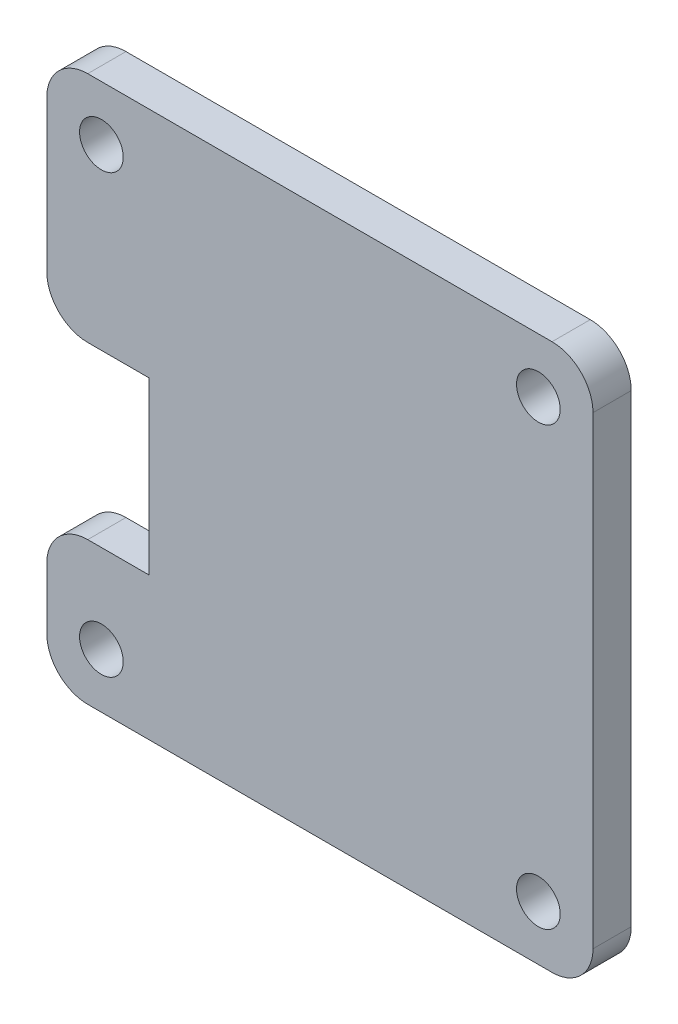
ISO-10303-21;
HEADER;
FILE_DESCRIPTION(('STEP AP214'),'2;1');
FILE_NAME('part.step','',(''),(''),'','','');
FILE_SCHEMA(('AUTOMOTIVE_DESIGN { 1 0 10303 214 1 1 1 1 }'));
ENDSEC;
DATA;
#1=APPLICATION_CONTEXT('core data for automotive mechanical design processes');
#2=APPLICATION_PROTOCOL_DEFINITION('international standard','automotive_design',2000,#1);
#3=PRODUCT_CONTEXT('',#1,'mechanical');
#4=PRODUCT('Part','Part','',(#3));
#5=PRODUCT_RELATED_PRODUCT_CATEGORY('part','',(#4));
#6=PRODUCT_DEFINITION_FORMATION('','',#4);
#7=PRODUCT_DEFINITION_CONTEXT('part definition',#1,'design');
#8=PRODUCT_DEFINITION('design','',#6,#7);
#9=PRODUCT_DEFINITION_SHAPE('','',#8);
#10=(LENGTH_UNIT() NAMED_UNIT(*) SI_UNIT(.MILLI.,.METRE.));
#11=(NAMED_UNIT(*) PLANE_ANGLE_UNIT() SI_UNIT($,.RADIAN.));
#12=(NAMED_UNIT(*) SI_UNIT($,.STERADIAN.) SOLID_ANGLE_UNIT());
#13=UNCERTAINTY_MEASURE_WITH_UNIT(LENGTH_MEASURE(1.E-05),#10,'distance_accuracy_value','');
#14=(GEOMETRIC_REPRESENTATION_CONTEXT(3) GLOBAL_UNCERTAINTY_ASSIGNED_CONTEXT((#13)) GLOBAL_UNIT_ASSIGNED_CONTEXT((#10,
#11,#12)) REPRESENTATION_CONTEXT('',''));
#15=CARTESIAN_POINT('',(0.,0.,0.));
#16=DIRECTION('',(0.,0.,1.));
#17=DIRECTION('',(1.,0.,0.));
#18=AXIS2_PLACEMENT_3D('',#15,#16,#17);
#19=CARTESIAN_POINT('',(0.,0.,2.8));
#20=DIRECTION('',(0.,0.,1.));
#21=DIRECTION('',(1.,0.,0.));
#22=AXIS2_PLACEMENT_3D('',#19,#20,#21);
#23=PLANE('',#22);
#24=CARTESIAN_POINT('',(16.,-16.,2.8));
#25=DIRECTION('',(0.,0.,1.));
#26=DIRECTION('',(1.,0.,0.));
#27=AXIS2_PLACEMENT_3D('',#24,#25,#26);
#28=CIRCLE('',#27,1.6);
#29=CARTESIAN_POINT('',(17.6,-16.,2.8));
#30=VERTEX_POINT('',#29);
#31=EDGE_CURVE('E280',#30,#30,#28,.T.);
#32=ORIENTED_EDGE('',*,*,#31,.F.);
#33=EDGE_LOOP('',(#32));
#34=FACE_BOUND('',#33,.T.);
#35=CARTESIAN_POINT('',(-16.,16.,2.8));
#36=DIRECTION('',(0.,0.,1.));
#37=DIRECTION('',(1.,0.,0.));
#38=AXIS2_PLACEMENT_3D('',#35,#36,#37);
#39=CIRCLE('',#38,1.6);
#40=CARTESIAN_POINT('',(-14.4,16.,2.8));
#41=VERTEX_POINT('',#40);
#42=EDGE_CURVE('E175',#41,#41,#39,.T.);
#43=ORIENTED_EDGE('',*,*,#42,.F.);
#44=EDGE_LOOP('',(#43));
#45=FACE_BOUND('',#44,.T.);
#46=DIRECTION('',(-1.,0.,0.));
#47=VECTOR('',#46,1.);
#48=CARTESIAN_POINT('',(-12.5,-9.54999999999999,2.8));
#49=LINE('',#48,#47);
#50=CARTESIAN_POINT('',(-12.5,-9.54999999999999,2.8));
#51=VERTEX_POINT('',#50);
#52=CARTESIAN_POINT('',(-17.,-9.54999999999999,2.8));
#53=VERTEX_POINT('',#52);
#54=EDGE_CURVE('E162',#51,#53,#49,.T.);
#55=ORIENTED_EDGE('',*,*,#54,.T.);
#56=CARTESIAN_POINT('',(-17.,-12.55,2.8));
#57=DIRECTION('',(0.,0.,1.));
#58=DIRECTION('',(1.,0.,0.));
#59=AXIS2_PLACEMENT_3D('',#56,#57,#58);
#60=CIRCLE('',#59,3.);
#61=CARTESIAN_POINT('',(-20.,-12.55,2.8));
#62=VERTEX_POINT('',#61);
#63=EDGE_CURVE('E220',#53,#62,#60,.T.);
#64=ORIENTED_EDGE('',*,*,#63,.T.);
#65=DIRECTION('',(0.,-1.,0.));
#66=VECTOR('',#65,1.);
#67=CARTESIAN_POINT('',(-20.,-9.54999999999999,2.8));
#68=LINE('',#67,#66);
#69=CARTESIAN_POINT('',(-20.,-17.,2.8));
#70=VERTEX_POINT('',#69);
#71=EDGE_CURVE('E164',#62,#70,#68,.T.);
#72=ORIENTED_EDGE('',*,*,#71,.T.);
#73=CARTESIAN_POINT('',(-17.,-17.,2.8));
#74=DIRECTION('',(0.,0.,1.));
#75=DIRECTION('',(1.,0.,0.));
#76=AXIS2_PLACEMENT_3D('',#73,#74,#75);
#77=CIRCLE('',#76,3.);
#78=CARTESIAN_POINT('',(-17.,-20.,2.8));
#79=VERTEX_POINT('',#78);
#80=EDGE_CURVE('E55',#70,#79,#77,.T.);
#81=ORIENTED_EDGE('',*,*,#80,.T.);
#82=DIRECTION('',(1.,0.,0.));
#83=VECTOR('',#82,1.);
#84=CARTESIAN_POINT('',(-20.,-20.,2.8));
#85=LINE('',#84,#83);
#86=CARTESIAN_POINT('',(17.,-20.,2.8));
#87=VERTEX_POINT('',#86);
#88=EDGE_CURVE('E169',#79,#87,#85,.T.);
#89=ORIENTED_EDGE('',*,*,#88,.T.);
#90=CARTESIAN_POINT('',(17.,-17.,2.8));
#91=DIRECTION('',(0.,0.,1.));
#92=DIRECTION('',(1.,0.,0.));
#93=AXIS2_PLACEMENT_3D('',#90,#91,#92);
#94=CIRCLE('',#93,3.);
#95=CARTESIAN_POINT('',(20.,-17.,2.8));
#96=VERTEX_POINT('',#95);
#97=EDGE_CURVE('E214',#87,#96,#94,.T.);
#98=ORIENTED_EDGE('',*,*,#97,.T.);
#99=DIRECTION('',(0.,1.,0.));
#100=VECTOR('',#99,1.);
#101=CARTESIAN_POINT('',(20.,20.,2.8));
#102=LINE('',#101,#100);
#103=CARTESIAN_POINT('',(20.,17.,2.8));
#104=VERTEX_POINT('',#103);
#105=EDGE_CURVE('E192',#96,#104,#102,.T.);
#106=ORIENTED_EDGE('',*,*,#105,.T.);
#107=CARTESIAN_POINT('',(17.,17.,2.8));
#108=DIRECTION('',(0.,0.,1.));
#109=DIRECTION('',(1.,0.,0.));
#110=AXIS2_PLACEMENT_3D('',#107,#108,#109);
#111=CIRCLE('',#110,3.);
#112=CARTESIAN_POINT('',(17.,20.,2.8));
#113=VERTEX_POINT('',#112);
#114=EDGE_CURVE('E212',#104,#113,#111,.T.);
#115=ORIENTED_EDGE('',*,*,#114,.T.);
#116=DIRECTION('',(-1.,0.,0.));
#117=VECTOR('',#116,1.);
#118=CARTESIAN_POINT('',(-20.,20.,2.8));
#119=LINE('',#118,#117);
#120=CARTESIAN_POINT('',(-17.,20.,2.8));
#121=VERTEX_POINT('',#120);
#122=EDGE_CURVE('E249',#113,#121,#119,.T.);
#123=ORIENTED_EDGE('',*,*,#122,.T.);
#124=CARTESIAN_POINT('',(-17.,17.,2.8));
#125=DIRECTION('',(0.,0.,1.));
#126=DIRECTION('',(1.,0.,0.));
#127=AXIS2_PLACEMENT_3D('',#124,#125,#126);
#128=CIRCLE('',#127,3.);
#129=CARTESIAN_POINT('',(-20.,17.,2.8));
#130=VERTEX_POINT('',#129);
#131=EDGE_CURVE('E216',#121,#130,#128,.T.);
#132=ORIENTED_EDGE('',*,*,#131,.T.);
#133=DIRECTION('',(0.,-1.,0.));
#134=VECTOR('',#133,1.);
#135=CARTESIAN_POINT('',(-20.,2.95000000000001,2.8));
#136=LINE('',#135,#134);
#137=CARTESIAN_POINT('',(-20.,5.95000000000001,2.8));
#138=VERTEX_POINT('',#137);
#139=EDGE_CURVE('E147',#130,#138,#136,.T.);
#140=ORIENTED_EDGE('',*,*,#139,.T.);
#141=CARTESIAN_POINT('',(-17.,5.95000000000001,2.8));
#142=DIRECTION('',(0.,0.,1.));
#143=DIRECTION('',(1.,0.,0.));
#144=AXIS2_PLACEMENT_3D('',#141,#142,#143);
#145=CIRCLE('',#144,3.);
#146=CARTESIAN_POINT('',(-17.,2.95000000000001,2.8));
#147=VERTEX_POINT('',#146);
#148=EDGE_CURVE('E143',#138,#147,#145,.T.);
#149=ORIENTED_EDGE('',*,*,#148,.T.);
#150=DIRECTION('',(1.,0.,0.));
#151=VECTOR('',#150,1.);
#152=CARTESIAN_POINT('',(-12.5,2.95000000000001,2.8));
#153=LINE('',#152,#151);
#154=CARTESIAN_POINT('',(-12.5,2.95000000000001,2.8));
#155=VERTEX_POINT('',#154);
#156=EDGE_CURVE('E134',#147,#155,#153,.T.);
#157=ORIENTED_EDGE('',*,*,#156,.T.);
#158=DIRECTION('',(0.,-1.,0.));
#159=VECTOR('',#158,1.);
#160=CARTESIAN_POINT('',(-12.5,-9.54999999999999,2.8));
#161=LINE('',#160,#159);
#162=EDGE_CURVE('E139',#155,#51,#161,.T.);
#163=ORIENTED_EDGE('',*,*,#162,.T.);
#164=EDGE_LOOP('',(#55,#64,#72,#81,#89,#98,#106,#115,#123,#132,#140,#149,#157,#163));
#165=FACE_BOUND('',#164,.T.);
#166=CARTESIAN_POINT('',(16.,16.,2.8));
#167=DIRECTION('',(0.,0.,1.));
#168=DIRECTION('',(1.,0.,0.));
#169=AXIS2_PLACEMENT_3D('',#166,#167,#168);
#170=CIRCLE('',#169,1.6);
#171=CARTESIAN_POINT('',(17.6,16.,2.8));
#172=VERTEX_POINT('',#171);
#173=EDGE_CURVE('E274',#172,#172,#170,.T.);
#174=ORIENTED_EDGE('',*,*,#173,.F.);
#175=EDGE_LOOP('',(#174));
#176=FACE_BOUND('',#175,.T.);
#177=CARTESIAN_POINT('',(-16.,-16.,2.8));
#178=DIRECTION('',(0.,0.,1.));
#179=DIRECTION('',(1.,0.,0.));
#180=AXIS2_PLACEMENT_3D('',#177,#178,#179);
#181=CIRCLE('',#180,1.6);
#182=CARTESIAN_POINT('',(-14.4,-16.,2.8));
#183=VERTEX_POINT('',#182);
#184=EDGE_CURVE('E286',#183,#183,#181,.T.);
#185=ORIENTED_EDGE('',*,*,#184,.F.);
#186=EDGE_LOOP('',(#185));
#187=FACE_BOUND('',#186,.T.);
#188=ADVANCED_FACE('F33',(#34,#45,#165,#176,#187),#23,.T.);
#189=CARTESIAN_POINT('',(0.,0.,0.));
#190=DIRECTION('',(0.,0.,1.));
#191=DIRECTION('',(1.,0.,0.));
#192=AXIS2_PLACEMENT_3D('',#189,#190,#191);
#193=PLANE('',#192);
#194=DIRECTION('',(0.,-1.,0.));
#195=VECTOR('',#194,1.);
#196=CARTESIAN_POINT('',(-20.,-9.54999999999999,0.));
#197=LINE('',#196,#195);
#198=CARTESIAN_POINT('',(-20.,-12.55,0.));
#199=VERTEX_POINT('',#198);
#200=CARTESIAN_POINT('',(-20.,-17.,0.));
#201=VERTEX_POINT('',#200);
#202=EDGE_CURVE('E187',#199,#201,#197,.T.);
#203=ORIENTED_EDGE('',*,*,#202,.F.);
#204=CARTESIAN_POINT('',(-17.,-12.55,0.));
#205=DIRECTION('',(0.,0.,1.));
#206=DIRECTION('',(1.,0.,0.));
#207=AXIS2_PLACEMENT_3D('',#204,#205,#206);
#208=CIRCLE('',#207,3.);
#209=CARTESIAN_POINT('',(-17.,-9.54999999999999,0.));
#210=VERTEX_POINT('',#209);
#211=EDGE_CURVE('E208',#199,#210,#208,.F.);
#212=ORIENTED_EDGE('',*,*,#211,.T.);
#213=DIRECTION('',(-1.,0.,0.));
#214=VECTOR('',#213,1.);
#215=CARTESIAN_POINT('',(-12.5,-9.54999999999999,0.));
#216=LINE('',#215,#214);
#217=CARTESIAN_POINT('',(-12.5,-9.54999999999999,0.));
#218=VERTEX_POINT('',#217);
#219=EDGE_CURVE('E184',#218,#210,#216,.T.);
#220=ORIENTED_EDGE('',*,*,#219,.F.);
#221=DIRECTION('',(0.,-1.,0.));
#222=VECTOR('',#221,1.);
#223=CARTESIAN_POINT('',(-12.5,-9.54999999999999,0.));
#224=LINE('',#223,#222);
#225=CARTESIAN_POINT('',(-12.5,2.95000000000001,0.));
#226=VERTEX_POINT('',#225);
#227=EDGE_CURVE('E182',#226,#218,#224,.T.);
#228=ORIENTED_EDGE('',*,*,#227,.F.);
#229=DIRECTION('',(1.,0.,0.));
#230=VECTOR('',#229,1.);
#231=CARTESIAN_POINT('',(-12.5,2.95000000000001,0.));
#232=LINE('',#231,#230);
#233=CARTESIAN_POINT('',(-17.,2.95000000000001,0.));
#234=VERTEX_POINT('',#233);
#235=EDGE_CURVE('E153',#234,#226,#232,.T.);
#236=ORIENTED_EDGE('',*,*,#235,.F.);
#237=CARTESIAN_POINT('',(-17.,5.95000000000001,0.));
#238=DIRECTION('',(0.,0.,1.));
#239=DIRECTION('',(1.,0.,0.));
#240=AXIS2_PLACEMENT_3D('',#237,#238,#239);
#241=CIRCLE('',#240,3.);
#242=CARTESIAN_POINT('',(-20.,5.95000000000001,0.));
#243=VERTEX_POINT('',#242);
#244=EDGE_CURVE('E206',#234,#243,#241,.F.);
#245=ORIENTED_EDGE('',*,*,#244,.T.);
#246=DIRECTION('',(0.,-1.,0.));
#247=VECTOR('',#246,1.);
#248=CARTESIAN_POINT('',(-20.,2.95000000000001,0.));
#249=LINE('',#248,#247);
#250=CARTESIAN_POINT('',(-20.,17.,0.));
#251=VERTEX_POINT('',#250);
#252=EDGE_CURVE('E178',#251,#243,#249,.T.);
#253=ORIENTED_EDGE('',*,*,#252,.F.);
#254=CARTESIAN_POINT('',(-17.,17.,0.));
#255=DIRECTION('',(0.,0.,1.));
#256=DIRECTION('',(1.,0.,0.));
#257=AXIS2_PLACEMENT_3D('',#254,#255,#256);
#258=CIRCLE('',#257,3.);
#259=CARTESIAN_POINT('',(-17.,20.,0.));
#260=VERTEX_POINT('',#259);
#261=EDGE_CURVE('E202',#251,#260,#258,.F.);
#262=ORIENTED_EDGE('',*,*,#261,.T.);
#263=DIRECTION('',(-1.,0.,0.));
#264=VECTOR('',#263,1.);
#265=CARTESIAN_POINT('',(-20.,20.,0.));
#266=LINE('',#265,#264);
#267=CARTESIAN_POINT('',(17.,20.,0.));
#268=VERTEX_POINT('',#267);
#269=EDGE_CURVE('E174',#268,#260,#266,.T.);
#270=ORIENTED_EDGE('',*,*,#269,.F.);
#271=CARTESIAN_POINT('',(17.,17.,0.));
#272=DIRECTION('',(0.,0.,1.));
#273=DIRECTION('',(1.,0.,0.));
#274=AXIS2_PLACEMENT_3D('',#271,#272,#273);
#275=CIRCLE('',#274,3.);
#276=CARTESIAN_POINT('',(20.,17.,0.));
#277=VERTEX_POINT('',#276);
#278=EDGE_CURVE('E198',#268,#277,#275,.F.);
#279=ORIENTED_EDGE('',*,*,#278,.T.);
#280=DIRECTION('',(0.,1.,0.));
#281=VECTOR('',#280,1.);
#282=CARTESIAN_POINT('',(20.,20.,0.));
#283=LINE('',#282,#281);
#284=CARTESIAN_POINT('',(20.,-17.,0.));
#285=VERTEX_POINT('',#284);
#286=EDGE_CURVE('E171',#285,#277,#283,.T.);
#287=ORIENTED_EDGE('',*,*,#286,.F.);
#288=CARTESIAN_POINT('',(17.,-17.,0.));
#289=DIRECTION('',(0.,0.,1.));
#290=DIRECTION('',(1.,0.,0.));
#291=AXIS2_PLACEMENT_3D('',#288,#289,#290);
#292=CIRCLE('',#291,3.);
#293=CARTESIAN_POINT('',(17.,-20.,0.));
#294=VERTEX_POINT('',#293);
#295=EDGE_CURVE('E200',#285,#294,#292,.F.);
#296=ORIENTED_EDGE('',*,*,#295,.T.);
#297=DIRECTION('',(1.,0.,0.));
#298=VECTOR('',#297,1.);
#299=CARTESIAN_POINT('',(-20.,-20.,0.));
#300=LINE('',#299,#298);
#301=CARTESIAN_POINT('',(-17.,-20.,0.));
#302=VERTEX_POINT('',#301);
#303=EDGE_CURVE('E190',#302,#294,#300,.T.);
#304=ORIENTED_EDGE('',*,*,#303,.F.);
#305=CARTESIAN_POINT('',(-17.,-17.,0.));
#306=DIRECTION('',(0.,0.,1.));
#307=DIRECTION('',(1.,0.,0.));
#308=AXIS2_PLACEMENT_3D('',#305,#306,#307);
#309=CIRCLE('',#308,3.);
#310=EDGE_CURVE('E204',#302,#201,#309,.F.);
#311=ORIENTED_EDGE('',*,*,#310,.T.);
#312=EDGE_LOOP('',(#203,#212,#220,#228,#236,#245,#253,#262,#270,#279,#287,#296,#304,#311));
#313=FACE_BOUND('',#312,.T.);
#314=CARTESIAN_POINT('',(-16.,16.,0.));
#315=DIRECTION('',(0.,0.,1.));
#316=DIRECTION('',(1.,0.,0.));
#317=AXIS2_PLACEMENT_3D('',#314,#315,#316);
#318=CIRCLE('',#317,1.6);
#319=CARTESIAN_POINT('',(-14.4,16.,0.));
#320=VERTEX_POINT('',#319);
#321=EDGE_CURVE('E271',#320,#320,#318,.T.);
#322=ORIENTED_EDGE('',*,*,#321,.T.);
#323=EDGE_LOOP('',(#322));
#324=FACE_BOUND('',#323,.T.);
#325=CARTESIAN_POINT('',(16.,16.,0.));
#326=DIRECTION('',(0.,0.,1.));
#327=DIRECTION('',(1.,0.,0.));
#328=AXIS2_PLACEMENT_3D('',#325,#326,#327);
#329=CIRCLE('',#328,1.6);
#330=CARTESIAN_POINT('',(17.6,16.,0.));
#331=VERTEX_POINT('',#330);
#332=EDGE_CURVE('E277',#331,#331,#329,.T.);
#333=ORIENTED_EDGE('',*,*,#332,.T.);
#334=EDGE_LOOP('',(#333));
#335=FACE_BOUND('',#334,.T.);
#336=CARTESIAN_POINT('',(16.,-16.,0.));
#337=DIRECTION('',(0.,0.,1.));
#338=DIRECTION('',(1.,0.,0.));
#339=AXIS2_PLACEMENT_3D('',#336,#337,#338);
#340=CIRCLE('',#339,1.6);
#341=CARTESIAN_POINT('',(17.6,-16.,0.));
#342=VERTEX_POINT('',#341);
#343=EDGE_CURVE('E283',#342,#342,#340,.T.);
#344=ORIENTED_EDGE('',*,*,#343,.T.);
#345=EDGE_LOOP('',(#344));
#346=FACE_BOUND('',#345,.T.);
#347=CARTESIAN_POINT('',(-16.,-16.,0.));
#348=DIRECTION('',(0.,0.,1.));
#349=DIRECTION('',(1.,0.,0.));
#350=AXIS2_PLACEMENT_3D('',#347,#348,#349);
#351=CIRCLE('',#350,1.6);
#352=CARTESIAN_POINT('',(-14.4,-16.,0.));
#353=VERTEX_POINT('',#352);
#354=EDGE_CURVE('E289',#353,#353,#351,.T.);
#355=ORIENTED_EDGE('',*,*,#354,.T.);
#356=EDGE_LOOP('',(#355));
#357=FACE_BOUND('',#356,.T.);
#358=ADVANCED_FACE('F258',(#313,#324,#335,#346,#357),#193,.F.);
#359=CARTESIAN_POINT('',(20.,20.,2.8));
#360=DIRECTION('',(-1.,0.,0.));
#361=DIRECTION('',(0.,0.,1.));
#362=AXIS2_PLACEMENT_3D('',#359,#360,#361);
#363=PLANE('',#362);
#364=ORIENTED_EDGE('',*,*,#105,.F.);
#365=DIRECTION('',(0.,0.,-1.));
#366=VECTOR('',#365,1.);
#367=CARTESIAN_POINT('',(20.,-17.,2.8));
#368=LINE('',#367,#366);
#369=EDGE_CURVE('E11',#96,#285,#368,.T.);
#370=ORIENTED_EDGE('',*,*,#369,.T.);
#371=ORIENTED_EDGE('',*,*,#286,.T.);
#372=DIRECTION('',(0.,0.,-1.));
#373=VECTOR('',#372,1.);
#374=CARTESIAN_POINT('',(20.,17.,2.8));
#375=LINE('',#374,#373);
#376=EDGE_CURVE('E41',#277,#104,#375,.F.);
#377=ORIENTED_EDGE('',*,*,#376,.T.);
#378=EDGE_LOOP('',(#364,#370,#371,#377));
#379=FACE_BOUND('',#378,.T.);
#380=ADVANCED_FACE('F241',(#379),#363,.F.);
#381=CARTESIAN_POINT('',(-20.,20.,2.8));
#382=DIRECTION('',(0.,-1.,0.));
#383=DIRECTION('',(0.,0.,-1.));
#384=AXIS2_PLACEMENT_3D('',#381,#382,#383);
#385=PLANE('',#384);
#386=ORIENTED_EDGE('',*,*,#269,.T.);
#387=DIRECTION('',(0.,0.,-1.));
#388=VECTOR('',#387,1.);
#389=CARTESIAN_POINT('',(-17.,20.,2.8));
#390=LINE('',#389,#388);
#391=EDGE_CURVE('E236',#260,#121,#390,.F.);
#392=ORIENTED_EDGE('',*,*,#391,.T.);
#393=ORIENTED_EDGE('',*,*,#122,.F.);
#394=DIRECTION('',(0.,0.,-1.));
#395=VECTOR('',#394,1.);
#396=CARTESIAN_POINT('',(17.,20.,2.8));
#397=LINE('',#396,#395);
#398=EDGE_CURVE('E233',#113,#268,#397,.T.);
#399=ORIENTED_EDGE('',*,*,#398,.T.);
#400=EDGE_LOOP('',(#386,#392,#393,#399));
#401=FACE_BOUND('',#400,.T.);
#402=ADVANCED_FACE('F254',(#401),#385,.F.);
#403=CARTESIAN_POINT('',(-20.,2.95000000000001,2.8));
#404=DIRECTION('',(1.,0.,0.));
#405=DIRECTION('',(0.,1.,0.));
#406=AXIS2_PLACEMENT_3D('',#403,#404,#405);
#407=PLANE('',#406);
#408=ORIENTED_EDGE('',*,*,#252,.T.);
#409=DIRECTION('',(0.,0.,-1.));
#410=VECTOR('',#409,1.);
#411=CARTESIAN_POINT('',(-20.,5.95000000000001,2.8));
#412=LINE('',#411,#410);
#413=EDGE_CURVE('E227',#243,#138,#412,.F.);
#414=ORIENTED_EDGE('',*,*,#413,.T.);
#415=ORIENTED_EDGE('',*,*,#139,.F.);
#416=DIRECTION('',(0.,0.,-1.));
#417=VECTOR('',#416,1.);
#418=CARTESIAN_POINT('',(-20.,17.,2.8));
#419=LINE('',#418,#417);
#420=EDGE_CURVE('E224',#130,#251,#419,.T.);
#421=ORIENTED_EDGE('',*,*,#420,.T.);
#422=EDGE_LOOP('',(#408,#414,#415,#421));
#423=FACE_BOUND('',#422,.T.);
#424=ADVANCED_FACE('F267',(#423),#407,.F.);
#425=CARTESIAN_POINT('',(-12.5,2.95000000000001,2.8));
#426=DIRECTION('',(0.,1.,0.));
#427=DIRECTION('',(0.,0.,1.));
#428=AXIS2_PLACEMENT_3D('',#425,#426,#427);
#429=PLANE('',#428);
#430=ORIENTED_EDGE('',*,*,#156,.F.);
#431=DIRECTION('',(0.,0.,-1.));
#432=VECTOR('',#431,1.);
#433=CARTESIAN_POINT('',(-17.,2.95000000000001,2.8));
#434=LINE('',#433,#432);
#435=EDGE_CURVE('E222',#147,#234,#434,.T.);
#436=ORIENTED_EDGE('',*,*,#435,.T.);
#437=ORIENTED_EDGE('',*,*,#235,.T.);
#438=DIRECTION('',(0.,0.,-1.));
#439=VECTOR('',#438,1.);
#440=CARTESIAN_POINT('',(-12.5,2.95000000000001,2.8));
#441=LINE('',#440,#439);
#442=EDGE_CURVE('E150',#155,#226,#441,.T.);
#443=ORIENTED_EDGE('',*,*,#442,.F.);
#444=EDGE_LOOP('',(#430,#436,#437,#443));
#445=FACE_BOUND('',#444,.T.);
#446=ADVANCED_FACE('F151',(#445),#429,.F.);
#447=CARTESIAN_POINT('',(-12.5,-9.54999999999999,2.8));
#448=DIRECTION('',(1.,0.,0.));
#449=DIRECTION('',(0.,1.,0.));
#450=AXIS2_PLACEMENT_3D('',#447,#448,#449);
#451=PLANE('',#450);
#452=ORIENTED_EDGE('',*,*,#227,.T.);
#453=DIRECTION('',(0.,0.,-1.));
#454=VECTOR('',#453,1.);
#455=CARTESIAN_POINT('',(-12.5,-9.54999999999999,2.8));
#456=LINE('',#455,#454);
#457=EDGE_CURVE('E157',#51,#218,#456,.T.);
#458=ORIENTED_EDGE('',*,*,#457,.F.);
#459=ORIENTED_EDGE('',*,*,#162,.F.);
#460=ORIENTED_EDGE('',*,*,#442,.T.);
#461=EDGE_LOOP('',(#452,#458,#459,#460));
#462=FACE_BOUND('',#461,.T.);
#463=ADVANCED_FACE('F159',(#462),#451,.F.);
#464=CARTESIAN_POINT('',(-12.5,-9.54999999999999,2.8));
#465=DIRECTION('',(0.,-1.,0.));
#466=DIRECTION('',(1.,0.,0.));
#467=AXIS2_PLACEMENT_3D('',#464,#465,#466);
#468=PLANE('',#467);
#469=ORIENTED_EDGE('',*,*,#219,.T.);
#470=DIRECTION('',(0.,0.,-1.));
#471=VECTOR('',#470,1.);
#472=CARTESIAN_POINT('',(-17.,-9.54999999999999,2.8));
#473=LINE('',#472,#471);
#474=EDGE_CURVE('E210',#210,#53,#473,.F.);
#475=ORIENTED_EDGE('',*,*,#474,.T.);
#476=ORIENTED_EDGE('',*,*,#54,.F.);
#477=ORIENTED_EDGE('',*,*,#457,.T.);
#478=EDGE_LOOP('',(#469,#475,#476,#477));
#479=FACE_BOUND('',#478,.T.);
#480=ADVANCED_FACE('F317',(#479),#468,.F.);
#481=CARTESIAN_POINT('',(-20.,-9.54999999999999,2.8));
#482=DIRECTION('',(1.,0.,0.));
#483=DIRECTION('',(0.,1.,0.));
#484=AXIS2_PLACEMENT_3D('',#481,#482,#483);
#485=PLANE('',#484);
#486=ORIENTED_EDGE('',*,*,#71,.F.);
#487=DIRECTION('',(0.,0.,-1.));
#488=VECTOR('',#487,1.);
#489=CARTESIAN_POINT('',(-20.,-12.55,2.8));
#490=LINE('',#489,#488);
#491=EDGE_CURVE('E195',#62,#199,#490,.T.);
#492=ORIENTED_EDGE('',*,*,#491,.T.);
#493=ORIENTED_EDGE('',*,*,#202,.T.);
#494=DIRECTION('',(0.,0.,-1.));
#495=VECTOR('',#494,1.);
#496=CARTESIAN_POINT('',(-20.,-17.,2.8));
#497=LINE('',#496,#495);
#498=EDGE_CURVE('E156',#201,#70,#497,.F.);
#499=ORIENTED_EDGE('',*,*,#498,.T.);
#500=EDGE_LOOP('',(#486,#492,#493,#499));
#501=FACE_BOUND('',#500,.T.);
#502=ADVANCED_FACE('F314',(#501),#485,.F.);
#503=CARTESIAN_POINT('',(-20.,-20.,2.8));
#504=DIRECTION('',(0.,1.,0.));
#505=DIRECTION('',(0.,0.,1.));
#506=AXIS2_PLACEMENT_3D('',#503,#504,#505);
#507=PLANE('',#506);
#508=ORIENTED_EDGE('',*,*,#88,.F.);
#509=DIRECTION('',(0.,0.,-1.));
#510=VECTOR('',#509,1.);
#511=CARTESIAN_POINT('',(-17.,-20.,2.8));
#512=LINE('',#511,#510);
#513=EDGE_CURVE('E230',#79,#302,#512,.T.);
#514=ORIENTED_EDGE('',*,*,#513,.T.);
#515=ORIENTED_EDGE('',*,*,#303,.T.);
#516=DIRECTION('',(0.,0.,-1.));
#517=VECTOR('',#516,1.);
#518=CARTESIAN_POINT('',(17.,-20.,2.8));
#519=LINE('',#518,#517);
#520=EDGE_CURVE('E48',#294,#87,#519,.F.);
#521=ORIENTED_EDGE('',*,*,#520,.T.);
#522=EDGE_LOOP('',(#508,#514,#515,#521));
#523=FACE_BOUND('',#522,.T.);
#524=ADVANCED_FACE('F311',(#523),#507,.F.);
#525=CARTESIAN_POINT('',(-16.,16.,2.8));
#526=DIRECTION('',(0.,0.,-1.));
#527=DIRECTION('',(-1.,0.,0.));
#528=AXIS2_PLACEMENT_3D('',#525,#526,#527);
#529=CYLINDRICAL_SURFACE('',#528,1.6);
#530=ORIENTED_EDGE('',*,*,#42,.T.);
#531=EDGE_LOOP('',(#530));
#532=FACE_BOUND('',#531,.T.);
#533=ORIENTED_EDGE('',*,*,#321,.F.);
#534=EDGE_LOOP('',(#533));
#535=FACE_BOUND('',#534,.T.);
#536=ADVANCED_FACE('F308',(#532,#535),#529,.F.);
#537=CARTESIAN_POINT('',(16.,16.,2.8));
#538=DIRECTION('',(0.,0.,-1.));
#539=DIRECTION('',(-1.,0.,0.));
#540=AXIS2_PLACEMENT_3D('',#537,#538,#539);
#541=CYLINDRICAL_SURFACE('',#540,1.6);
#542=ORIENTED_EDGE('',*,*,#173,.T.);
#543=EDGE_LOOP('',(#542));
#544=FACE_BOUND('',#543,.T.);
#545=ORIENTED_EDGE('',*,*,#332,.F.);
#546=EDGE_LOOP('',(#545));
#547=FACE_BOUND('',#546,.T.);
#548=ADVANCED_FACE('F462',(#544,#547),#541,.F.);
#549=CARTESIAN_POINT('',(16.,-16.,2.8));
#550=DIRECTION('',(0.,0.,-1.));
#551=DIRECTION('',(-1.,0.,0.));
#552=AXIS2_PLACEMENT_3D('',#549,#550,#551);
#553=CYLINDRICAL_SURFACE('',#552,1.6);
#554=ORIENTED_EDGE('',*,*,#31,.T.);
#555=EDGE_LOOP('',(#554));
#556=FACE_BOUND('',#555,.T.);
#557=ORIENTED_EDGE('',*,*,#343,.F.);
#558=EDGE_LOOP('',(#557));
#559=FACE_BOUND('',#558,.T.);
#560=ADVANCED_FACE('F453',(#556,#559),#553,.F.);
#561=CARTESIAN_POINT('',(-16.,-16.,2.8));
#562=DIRECTION('',(0.,0.,-1.));
#563=DIRECTION('',(-1.,0.,0.));
#564=AXIS2_PLACEMENT_3D('',#561,#562,#563);
#565=CYLINDRICAL_SURFACE('',#564,1.6);
#566=ORIENTED_EDGE('',*,*,#184,.T.);
#567=EDGE_LOOP('',(#566));
#568=FACE_BOUND('',#567,.T.);
#569=ORIENTED_EDGE('',*,*,#354,.F.);
#570=EDGE_LOOP('',(#569));
#571=FACE_BOUND('',#570,.T.);
#572=ADVANCED_FACE('F295',(#568,#571),#565,.F.);
#573=CARTESIAN_POINT('',(-17.,-12.55,2.8));
#574=DIRECTION('',(0.,0.,-1.));
#575=DIRECTION('',(-1.,0.,0.));
#576=AXIS2_PLACEMENT_3D('',#573,#574,#575);
#577=CYLINDRICAL_SURFACE('',#576,3.);
#578=ORIENTED_EDGE('',*,*,#63,.F.);
#579=ORIENTED_EDGE('',*,*,#474,.F.);
#580=ORIENTED_EDGE('',*,*,#211,.F.);
#581=ORIENTED_EDGE('',*,*,#491,.F.);
#582=EDGE_LOOP('',(#578,#579,#580,#581));
#583=FACE_BOUND('',#582,.T.);
#584=ADVANCED_FACE('F332',(#583),#577,.T.);
#585=CARTESIAN_POINT('',(-17.,5.95000000000001,2.8));
#586=DIRECTION('',(0.,0.,-1.));
#587=DIRECTION('',(-1.,0.,0.));
#588=AXIS2_PLACEMENT_3D('',#585,#586,#587);
#589=CYLINDRICAL_SURFACE('',#588,3.);
#590=ORIENTED_EDGE('',*,*,#148,.F.);
#591=ORIENTED_EDGE('',*,*,#413,.F.);
#592=ORIENTED_EDGE('',*,*,#244,.F.);
#593=ORIENTED_EDGE('',*,*,#435,.F.);
#594=EDGE_LOOP('',(#590,#591,#592,#593));
#595=FACE_BOUND('',#594,.T.);
#596=ADVANCED_FACE('F335',(#595),#589,.T.);
#597=CARTESIAN_POINT('',(-17.,-17.,2.8));
#598=DIRECTION('',(0.,0.,-1.));
#599=DIRECTION('',(-1.,0.,0.));
#600=AXIS2_PLACEMENT_3D('',#597,#598,#599);
#601=CYLINDRICAL_SURFACE('',#600,3.);
#602=ORIENTED_EDGE('',*,*,#80,.F.);
#603=ORIENTED_EDGE('',*,*,#498,.F.);
#604=ORIENTED_EDGE('',*,*,#310,.F.);
#605=ORIENTED_EDGE('',*,*,#513,.F.);
#606=EDGE_LOOP('',(#602,#603,#604,#605));
#607=FACE_BOUND('',#606,.T.);
#608=ADVANCED_FACE('F339',(#607),#601,.T.);
#609=CARTESIAN_POINT('',(-17.,17.,2.8));
#610=DIRECTION('',(0.,0.,-1.));
#611=DIRECTION('',(-1.,0.,0.));
#612=AXIS2_PLACEMENT_3D('',#609,#610,#611);
#613=CYLINDRICAL_SURFACE('',#612,3.);
#614=ORIENTED_EDGE('',*,*,#131,.F.);
#615=ORIENTED_EDGE('',*,*,#391,.F.);
#616=ORIENTED_EDGE('',*,*,#261,.F.);
#617=ORIENTED_EDGE('',*,*,#420,.F.);
#618=EDGE_LOOP('',(#614,#615,#616,#617));
#619=FACE_BOUND('',#618,.T.);
#620=ADVANCED_FACE('F264',(#619),#613,.T.);
#621=CARTESIAN_POINT('',(17.,-17.,2.8));
#622=DIRECTION('',(0.,0.,-1.));
#623=DIRECTION('',(-1.,0.,0.));
#624=AXIS2_PLACEMENT_3D('',#621,#622,#623);
#625=CYLINDRICAL_SURFACE('',#624,3.);
#626=ORIENTED_EDGE('',*,*,#97,.F.);
#627=ORIENTED_EDGE('',*,*,#520,.F.);
#628=ORIENTED_EDGE('',*,*,#295,.F.);
#629=ORIENTED_EDGE('',*,*,#369,.F.);
#630=EDGE_LOOP('',(#626,#627,#628,#629));
#631=FACE_BOUND('',#630,.T.);
#632=ADVANCED_FACE('F345',(#631),#625,.T.);
#633=CARTESIAN_POINT('',(17.,17.,2.8));
#634=DIRECTION('',(0.,0.,-1.));
#635=DIRECTION('',(-1.,0.,0.));
#636=AXIS2_PLACEMENT_3D('',#633,#634,#635);
#637=CYLINDRICAL_SURFACE('',#636,3.);
#638=ORIENTED_EDGE('',*,*,#114,.F.);
#639=ORIENTED_EDGE('',*,*,#376,.F.);
#640=ORIENTED_EDGE('',*,*,#278,.F.);
#641=ORIENTED_EDGE('',*,*,#398,.F.);
#642=EDGE_LOOP('',(#638,#639,#640,#641));
#643=FACE_BOUND('',#642,.T.);
#644=ADVANCED_FACE('F35',(#643),#637,.T.);
#645=CLOSED_SHELL('',(#188,#358,#380,#402,#424,#446,#463,#480,#502,#524,#536,#548,#560,#572,
#584,#596,#608,#620,#632,#644));
#646=MANIFOLD_SOLID_BREP('B2',#645);
#647=ADVANCED_BREP_SHAPE_REPRESENTATION('',(#18,#646),#14);
#648=SHAPE_DEFINITION_REPRESENTATION(#9,#647);
ENDSEC;
END-ISO-10303-21;
